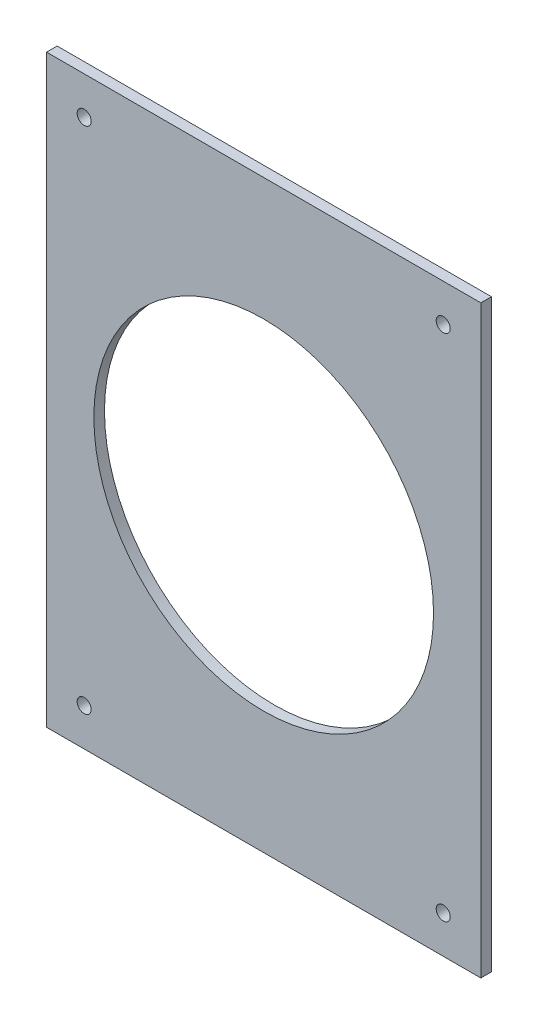
ISO-10303-21;
HEADER;
FILE_DESCRIPTION(('STEP AP214'),'2;1');
FILE_NAME('part.step','',(''),(''),'','','');
FILE_SCHEMA(('AUTOMOTIVE_DESIGN { 1 0 10303 214 1 1 1 1 }'));
ENDSEC;
DATA;
#1=APPLICATION_CONTEXT('core data for automotive mechanical design processes');
#2=APPLICATION_PROTOCOL_DEFINITION('international standard','automotive_design',2000,#1);
#3=PRODUCT_CONTEXT('',#1,'mechanical');
#4=PRODUCT('Part','Part','',(#3));
#5=PRODUCT_RELATED_PRODUCT_CATEGORY('part','',(#4));
#6=PRODUCT_DEFINITION_FORMATION('','',#4);
#7=PRODUCT_DEFINITION_CONTEXT('part definition',#1,'design');
#8=PRODUCT_DEFINITION('design','',#6,#7);
#9=PRODUCT_DEFINITION_SHAPE('','',#8);
#10=(LENGTH_UNIT() NAMED_UNIT(*) SI_UNIT(.MILLI.,.METRE.));
#11=(NAMED_UNIT(*) PLANE_ANGLE_UNIT() SI_UNIT($,.RADIAN.));
#12=(NAMED_UNIT(*) SI_UNIT($,.STERADIAN.) SOLID_ANGLE_UNIT());
#13=UNCERTAINTY_MEASURE_WITH_UNIT(LENGTH_MEASURE(1.E-05),#10,'distance_accuracy_value','');
#14=(GEOMETRIC_REPRESENTATION_CONTEXT(3) GLOBAL_UNCERTAINTY_ASSIGNED_CONTEXT((#13)) GLOBAL_UNIT_ASSIGNED_CONTEXT((#10,
#11,#12)) REPRESENTATION_CONTEXT('',''));
#15=CARTESIAN_POINT('',(0.,0.,0.));
#16=DIRECTION('',(0.,0.,1.));
#17=DIRECTION('',(1.,0.,0.));
#18=AXIS2_PLACEMENT_3D('',#15,#16,#17);
#19=CARTESIAN_POINT('',(0.,0.,6.35));
#20=DIRECTION('',(0.,0.,-1.));
#21=DIRECTION('',(-1.,0.,0.));
#22=AXIS2_PLACEMENT_3D('',#19,#20,#21);
#23=PLANE('',#22);
#24=CARTESIAN_POINT('',(-237.3,327.3,6.35));
#25=DIRECTION('',(0.,0.,1.));
#26=DIRECTION('',(1.,0.,0.));
#27=AXIS2_PLACEMENT_3D('',#24,#25,#26);
#28=CIRCLE('',#27,4.19999999999998);
#29=CARTESIAN_POINT('',(-233.1,327.3,6.35));
#30=VERTEX_POINT('',#29);
#31=EDGE_CURVE('E227',#30,#30,#28,.T.);
#32=ORIENTED_EDGE('',*,*,#31,.F.);
#33=EDGE_LOOP('',(#32));
#34=FACE_BOUND('',#33,.T.);
#35=CARTESIAN_POINT('',(-22.5,327.3,6.35));
#36=DIRECTION('',(0.,0.,1.));
#37=DIRECTION('',(1.,0.,0.));
#38=AXIS2_PLACEMENT_3D('',#35,#36,#37);
#39=CIRCLE('',#38,4.19999999999999);
#40=CARTESIAN_POINT('',(-18.3,327.3,6.35));
#41=VERTEX_POINT('',#40);
#42=EDGE_CURVE('E129',#41,#41,#39,.T.);
#43=ORIENTED_EDGE('',*,*,#42,.F.);
#44=EDGE_LOOP('',(#43));
#45=FACE_BOUND('',#44,.T.);
#46=CARTESIAN_POINT('',(-22.4999999999999,22.5,6.35));
#47=DIRECTION('',(0.,0.,1.));
#48=DIRECTION('',(1.,0.,0.));
#49=AXIS2_PLACEMENT_3D('',#46,#47,#48);
#50=CIRCLE('',#49,4.19999999999999);
#51=CARTESIAN_POINT('',(-18.2999999999999,22.5,6.35));
#52=VERTEX_POINT('',#51);
#53=EDGE_CURVE('E117',#52,#52,#50,.T.);
#54=ORIENTED_EDGE('',*,*,#53,.F.);
#55=EDGE_LOOP('',(#54));
#56=FACE_BOUND('',#55,.T.);
#57=CARTESIAN_POINT('',(-237.3,22.5,6.35));
#58=DIRECTION('',(0.,0.,1.));
#59=DIRECTION('',(1.,0.,0.));
#60=AXIS2_PLACEMENT_3D('',#57,#58,#59);
#61=CIRCLE('',#60,4.19999999999998);
#62=CARTESIAN_POINT('',(-233.1,22.5,6.35));
#63=VERTEX_POINT('',#62);
#64=EDGE_CURVE('E116',#63,#63,#61,.T.);
#65=ORIENTED_EDGE('',*,*,#64,.F.);
#66=EDGE_LOOP('',(#65));
#67=FACE_BOUND('',#66,.T.);
#68=DIRECTION('',(0.,1.,0.));
#69=VECTOR('',#68,1.);
#70=CARTESIAN_POINT('',(0.,349.8,6.35));
#71=LINE('',#70,#69);
#72=CARTESIAN_POINT('',(0.,0.,6.35));
#73=VERTEX_POINT('',#72);
#74=CARTESIAN_POINT('',(0.,349.8,6.35));
#75=VERTEX_POINT('',#74);
#76=EDGE_CURVE('E93',#73,#75,#71,.T.);
#77=ORIENTED_EDGE('',*,*,#76,.T.);
#78=DIRECTION('',(-1.,0.,0.));
#79=VECTOR('',#78,1.);
#80=CARTESIAN_POINT('',(-259.8,349.8,6.35));
#81=LINE('',#80,#79);
#82=CARTESIAN_POINT('',(-259.8,349.8,6.35));
#83=VERTEX_POINT('',#82);
#84=EDGE_CURVE('E88',#75,#83,#81,.T.);
#85=ORIENTED_EDGE('',*,*,#84,.T.);
#86=DIRECTION('',(0.,-1.,0.));
#87=VECTOR('',#86,1.);
#88=CARTESIAN_POINT('',(-259.8,0.,6.35));
#89=LINE('',#88,#87);
#90=CARTESIAN_POINT('',(-259.8,0.,6.35));
#91=VERTEX_POINT('',#90);
#92=EDGE_CURVE('E91',#83,#91,#89,.T.);
#93=ORIENTED_EDGE('',*,*,#92,.T.);
#94=DIRECTION('',(1.,0.,0.));
#95=VECTOR('',#94,1.);
#96=CARTESIAN_POINT('',(0.,0.,6.35));
#97=LINE('',#96,#95);
#98=EDGE_CURVE('E58',#91,#73,#97,.T.);
#99=ORIENTED_EDGE('',*,*,#98,.T.);
#100=EDGE_LOOP('',(#77,#85,#93,#99));
#101=FACE_BOUND('',#100,.T.);
#102=CARTESIAN_POINT('',(-129.9,174.9,6.35));
#103=DIRECTION('',(0.,0.,1.));
#104=DIRECTION('',(1.,0.,0.));
#105=AXIS2_PLACEMENT_3D('',#102,#103,#104);
#106=CIRCLE('',#105,101.6);
#107=CARTESIAN_POINT('',(-28.3,174.9,6.35));
#108=VERTEX_POINT('',#107);
#109=EDGE_CURVE('E109',#108,#108,#106,.T.);
#110=ORIENTED_EDGE('',*,*,#109,.F.);
#111=EDGE_LOOP('',(#110));
#112=FACE_BOUND('',#111,.T.);
#113=ADVANCED_FACE('F39',(#34,#45,#56,#67,#101,#112),#23,.F.);
#114=CARTESIAN_POINT('',(0.,0.,0.));
#115=DIRECTION('',(0.,0.,-1.));
#116=DIRECTION('',(-1.,0.,0.));
#117=AXIS2_PLACEMENT_3D('',#114,#115,#116);
#118=PLANE('',#117);
#119=CARTESIAN_POINT('',(-237.3,327.3,0.));
#120=DIRECTION('',(0.,0.,-1.));
#121=DIRECTION('',(-1.,0.,0.));
#122=AXIS2_PLACEMENT_3D('',#119,#120,#121);
#123=CIRCLE('',#122,4.19999999999998);
#124=CARTESIAN_POINT('',(-241.5,327.3,0.));
#125=VERTEX_POINT('',#124);
#126=EDGE_CURVE('E43',#125,#125,#123,.T.);
#127=ORIENTED_EDGE('',*,*,#126,.F.);
#128=EDGE_LOOP('',(#127));
#129=FACE_BOUND('',#128,.T.);
#130=CARTESIAN_POINT('',(-22.5,327.3,0.));
#131=DIRECTION('',(0.,0.,-1.));
#132=DIRECTION('',(-1.,0.,0.));
#133=AXIS2_PLACEMENT_3D('',#130,#131,#132);
#134=CIRCLE('',#133,4.19999999999999);
#135=CARTESIAN_POINT('',(-26.7,327.3,0.));
#136=VERTEX_POINT('',#135);
#137=EDGE_CURVE('E124',#136,#136,#134,.T.);
#138=ORIENTED_EDGE('',*,*,#137,.F.);
#139=EDGE_LOOP('',(#138));
#140=FACE_BOUND('',#139,.T.);
#141=CARTESIAN_POINT('',(-22.4999999999999,22.5,0.));
#142=DIRECTION('',(0.,0.,-1.));
#143=DIRECTION('',(-1.,0.,0.));
#144=AXIS2_PLACEMENT_3D('',#141,#142,#143);
#145=CIRCLE('',#144,4.19999999999999);
#146=CARTESIAN_POINT('',(-26.6999999999999,22.5,0.));
#147=VERTEX_POINT('',#146);
#148=EDGE_CURVE('E114',#147,#147,#145,.T.);
#149=ORIENTED_EDGE('',*,*,#148,.F.);
#150=EDGE_LOOP('',(#149));
#151=FACE_BOUND('',#150,.T.);
#152=CARTESIAN_POINT('',(-237.3,22.5,0.));
#153=DIRECTION('',(0.,0.,-1.));
#154=DIRECTION('',(-1.,0.,0.));
#155=AXIS2_PLACEMENT_3D('',#152,#153,#154);
#156=CIRCLE('',#155,4.19999999999998);
#157=CARTESIAN_POINT('',(-241.5,22.5,0.));
#158=VERTEX_POINT('',#157);
#159=EDGE_CURVE('E121',#158,#158,#156,.T.);
#160=ORIENTED_EDGE('',*,*,#159,.F.);
#161=EDGE_LOOP('',(#160));
#162=FACE_BOUND('',#161,.T.);
#163=DIRECTION('',(0.,1.,0.));
#164=VECTOR('',#163,1.);
#165=CARTESIAN_POINT('',(0.,349.8,0.));
#166=LINE('',#165,#164);
#167=CARTESIAN_POINT('',(0.,0.,0.));
#168=VERTEX_POINT('',#167);
#169=CARTESIAN_POINT('',(0.,349.8,0.));
#170=VERTEX_POINT('',#169);
#171=EDGE_CURVE('E106',#168,#170,#166,.T.);
#172=ORIENTED_EDGE('',*,*,#171,.F.);
#173=DIRECTION('',(1.,0.,0.));
#174=VECTOR('',#173,1.);
#175=CARTESIAN_POINT('',(0.,0.,0.));
#176=LINE('',#175,#174);
#177=CARTESIAN_POINT('',(-259.8,0.,0.));
#178=VERTEX_POINT('',#177);
#179=EDGE_CURVE('E81',#178,#168,#176,.T.);
#180=ORIENTED_EDGE('',*,*,#179,.F.);
#181=DIRECTION('',(0.,-1.,0.));
#182=VECTOR('',#181,1.);
#183=CARTESIAN_POINT('',(-259.8,0.,0.));
#184=LINE('',#183,#182);
#185=CARTESIAN_POINT('',(-259.8,349.8,0.));
#186=VERTEX_POINT('',#185);
#187=EDGE_CURVE('E75',#186,#178,#184,.T.);
#188=ORIENTED_EDGE('',*,*,#187,.F.);
#189=DIRECTION('',(-1.,0.,0.));
#190=VECTOR('',#189,1.);
#191=CARTESIAN_POINT('',(-259.8,349.8,0.));
#192=LINE('',#191,#190);
#193=EDGE_CURVE('E97',#170,#186,#192,.T.);
#194=ORIENTED_EDGE('',*,*,#193,.F.);
#195=EDGE_LOOP('',(#172,#180,#188,#194));
#196=FACE_BOUND('',#195,.T.);
#197=CARTESIAN_POINT('',(-129.9,174.9,0.));
#198=DIRECTION('',(0.,0.,1.));
#199=DIRECTION('',(1.,0.,0.));
#200=AXIS2_PLACEMENT_3D('',#197,#198,#199);
#201=CIRCLE('',#200,101.6);
#202=CARTESIAN_POINT('',(-28.3,174.9,0.));
#203=VERTEX_POINT('',#202);
#204=EDGE_CURVE('E135',#203,#203,#201,.T.);
#205=ORIENTED_EDGE('',*,*,#204,.T.);
#206=EDGE_LOOP('',(#205));
#207=FACE_BOUND('',#206,.T.);
#208=ADVANCED_FACE('F141',(#129,#140,#151,#162,#196,#207),#118,.T.);
#209=CARTESIAN_POINT('',(0.,349.8,6.35));
#210=DIRECTION('',(-1.,0.,0.));
#211=DIRECTION('',(0.,0.,1.));
#212=AXIS2_PLACEMENT_3D('',#209,#210,#211);
#213=PLANE('',#212);
#214=ORIENTED_EDGE('',*,*,#171,.T.);
#215=DIRECTION('',(0.,0.,-1.));
#216=VECTOR('',#215,1.);
#217=CARTESIAN_POINT('',(0.,349.8,6.35));
#218=LINE('',#217,#216);
#219=EDGE_CURVE('E11',#75,#170,#218,.T.);
#220=ORIENTED_EDGE('',*,*,#219,.F.);
#221=ORIENTED_EDGE('',*,*,#76,.F.);
#222=DIRECTION('',(0.,0.,-1.));
#223=VECTOR('',#222,1.);
#224=CARTESIAN_POINT('',(0.,0.,6.35));
#225=LINE('',#224,#223);
#226=EDGE_CURVE('E102',#73,#168,#225,.T.);
#227=ORIENTED_EDGE('',*,*,#226,.T.);
#228=EDGE_LOOP('',(#214,#220,#221,#227));
#229=FACE_BOUND('',#228,.T.);
#230=ADVANCED_FACE('F41',(#229),#213,.F.);
#231=CARTESIAN_POINT('',(-259.8,349.8,6.35));
#232=DIRECTION('',(0.,-1.,0.));
#233=DIRECTION('',(1.,0.,0.));
#234=AXIS2_PLACEMENT_3D('',#231,#232,#233);
#235=PLANE('',#234);
#236=ORIENTED_EDGE('',*,*,#193,.T.);
#237=DIRECTION('',(0.,0.,-1.));
#238=VECTOR('',#237,1.);
#239=CARTESIAN_POINT('',(-259.8,349.8,6.35));
#240=LINE('',#239,#238);
#241=EDGE_CURVE('E49',#83,#186,#240,.T.);
#242=ORIENTED_EDGE('',*,*,#241,.F.);
#243=ORIENTED_EDGE('',*,*,#84,.F.);
#244=ORIENTED_EDGE('',*,*,#219,.T.);
#245=EDGE_LOOP('',(#236,#242,#243,#244));
#246=FACE_BOUND('',#245,.T.);
#247=ADVANCED_FACE('F96',(#246),#235,.F.);
#248=CARTESIAN_POINT('',(-259.8,0.,6.35));
#249=DIRECTION('',(1.,0.,0.));
#250=DIRECTION('',(0.,0.,-1.));
#251=AXIS2_PLACEMENT_3D('',#248,#249,#250);
#252=PLANE('',#251);
#253=ORIENTED_EDGE('',*,*,#187,.T.);
#254=DIRECTION('',(0.,0.,-1.));
#255=VECTOR('',#254,1.);
#256=CARTESIAN_POINT('',(-259.8,0.,6.35));
#257=LINE('',#256,#255);
#258=EDGE_CURVE('E98',#91,#178,#257,.T.);
#259=ORIENTED_EDGE('',*,*,#258,.F.);
#260=ORIENTED_EDGE('',*,*,#92,.F.);
#261=ORIENTED_EDGE('',*,*,#241,.T.);
#262=EDGE_LOOP('',(#253,#259,#260,#261));
#263=FACE_BOUND('',#262,.T.);
#264=ADVANCED_FACE('F100',(#263),#252,.F.);
#265=CARTESIAN_POINT('',(0.,0.,6.35));
#266=DIRECTION('',(0.,1.,0.));
#267=DIRECTION('',(-1.,0.,0.));
#268=AXIS2_PLACEMENT_3D('',#265,#266,#267);
#269=PLANE('',#268);
#270=ORIENTED_EDGE('',*,*,#179,.T.);
#271=ORIENTED_EDGE('',*,*,#226,.F.);
#272=ORIENTED_EDGE('',*,*,#98,.F.);
#273=ORIENTED_EDGE('',*,*,#258,.T.);
#274=EDGE_LOOP('',(#270,#271,#272,#273));
#275=FACE_BOUND('',#274,.T.);
#276=ADVANCED_FACE('F146',(#275),#269,.F.);
#277=CARTESIAN_POINT('',(-129.9,174.9,6.35));
#278=DIRECTION('',(0.,0.,-1.));
#279=DIRECTION('',(-1.,0.,0.));
#280=AXIS2_PLACEMENT_3D('',#277,#278,#279);
#281=CYLINDRICAL_SURFACE('',#280,101.6);
#282=ORIENTED_EDGE('',*,*,#109,.T.);
#283=EDGE_LOOP('',(#282));
#284=FACE_BOUND('',#283,.T.);
#285=ORIENTED_EDGE('',*,*,#204,.F.);
#286=EDGE_LOOP('',(#285));
#287=FACE_BOUND('',#286,.T.);
#288=ADVANCED_FACE('F143',(#284,#287),#281,.F.);
#289=CARTESIAN_POINT('',(-237.3,22.5,6.35));
#290=DIRECTION('',(0.,0.,1.));
#291=DIRECTION('',(1.,0.,0.));
#292=AXIS2_PLACEMENT_3D('',#289,#290,#291);
#293=CYLINDRICAL_SURFACE('',#292,4.19999999999998);
#294=ORIENTED_EDGE('',*,*,#159,.T.);
#295=EDGE_LOOP('',(#294));
#296=FACE_BOUND('',#295,.T.);
#297=ORIENTED_EDGE('',*,*,#64,.T.);
#298=EDGE_LOOP('',(#297));
#299=FACE_BOUND('',#298,.T.);
#300=ADVANCED_FACE('F145',(#296,#299),#293,.F.);
#301=CARTESIAN_POINT('',(-22.4999999999999,22.5,6.35));
#302=DIRECTION('',(0.,0.,1.));
#303=DIRECTION('',(1.,0.,0.));
#304=AXIS2_PLACEMENT_3D('',#301,#302,#303);
#305=CYLINDRICAL_SURFACE('',#304,4.19999999999999);
#306=ORIENTED_EDGE('',*,*,#148,.T.);
#307=EDGE_LOOP('',(#306));
#308=FACE_BOUND('',#307,.T.);
#309=ORIENTED_EDGE('',*,*,#53,.T.);
#310=EDGE_LOOP('',(#309));
#311=FACE_BOUND('',#310,.T.);
#312=ADVANCED_FACE('F153',(#308,#311),#305,.F.);
#313=CARTESIAN_POINT('',(-22.5,327.3,6.35));
#314=DIRECTION('',(0.,0.,1.));
#315=DIRECTION('',(1.,0.,0.));
#316=AXIS2_PLACEMENT_3D('',#313,#314,#315);
#317=CYLINDRICAL_SURFACE('',#316,4.19999999999999);
#318=ORIENTED_EDGE('',*,*,#137,.T.);
#319=EDGE_LOOP('',(#318));
#320=FACE_BOUND('',#319,.T.);
#321=ORIENTED_EDGE('',*,*,#42,.T.);
#322=EDGE_LOOP('',(#321));
#323=FACE_BOUND('',#322,.T.);
#324=ADVANCED_FACE('F200',(#320,#323),#317,.F.);
#325=CARTESIAN_POINT('',(-237.3,327.3,6.35));
#326=DIRECTION('',(0.,0.,1.));
#327=DIRECTION('',(1.,0.,0.));
#328=AXIS2_PLACEMENT_3D('',#325,#326,#327);
#329=CYLINDRICAL_SURFACE('',#328,4.19999999999998);
#330=ORIENTED_EDGE('',*,*,#126,.T.);
#331=EDGE_LOOP('',(#330));
#332=FACE_BOUND('',#331,.T.);
#333=ORIENTED_EDGE('',*,*,#31,.T.);
#334=EDGE_LOOP('',(#333));
#335=FACE_BOUND('',#334,.T.);
#336=ADVANCED_FACE('F209',(#332,#335),#329,.F.);
#337=CLOSED_SHELL('',(#113,#208,#230,#247,#264,#276,#288,#300,#312,#324,#336));
#338=MANIFOLD_SOLID_BREP('B2',#337);
#339=ADVANCED_BREP_SHAPE_REPRESENTATION('',(#18,#338),#14);
#340=SHAPE_DEFINITION_REPRESENTATION(#9,#339);
ENDSEC;
END-ISO-10303-21;
